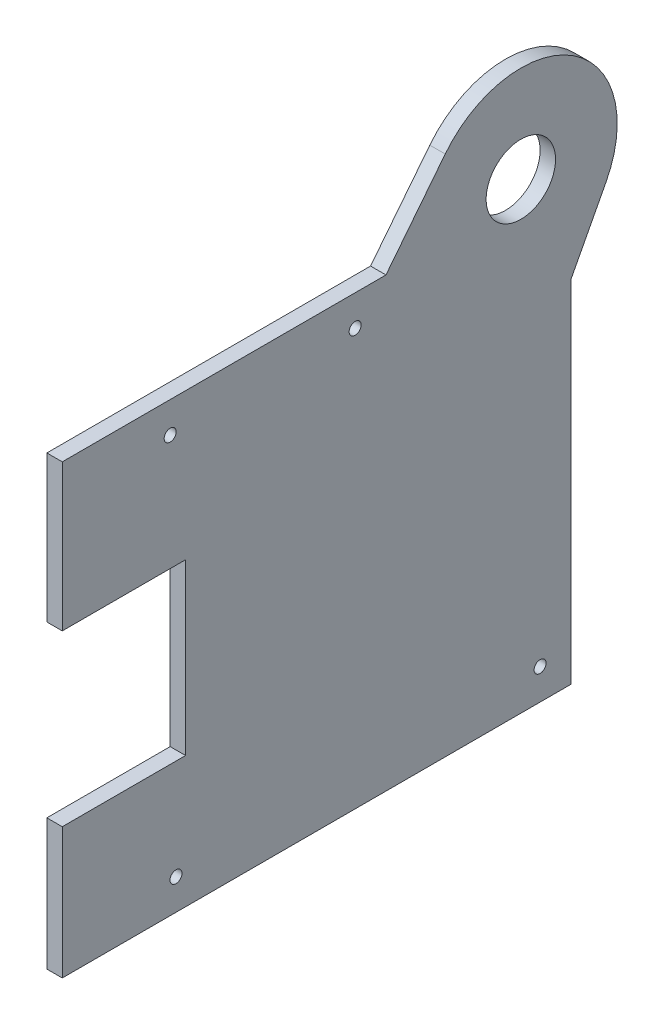
ISO-10303-21;
HEADER;
FILE_DESCRIPTION(('STEP AP214'),'2;1');
FILE_NAME('part.step','',(''),(''),'','','');
FILE_SCHEMA(('AUTOMOTIVE_DESIGN { 1 0 10303 214 1 1 1 1 }'));
ENDSEC;
DATA;
#1=APPLICATION_CONTEXT('core data for automotive mechanical design processes');
#2=APPLICATION_PROTOCOL_DEFINITION('international standard','automotive_design',2000,#1);
#3=PRODUCT_CONTEXT('',#1,'mechanical');
#4=PRODUCT('Part','Part','',(#3));
#5=PRODUCT_RELATED_PRODUCT_CATEGORY('part','',(#4));
#6=PRODUCT_DEFINITION_FORMATION('','',#4);
#7=PRODUCT_DEFINITION_CONTEXT('part definition',#1,'design');
#8=PRODUCT_DEFINITION('design','',#6,#7);
#9=PRODUCT_DEFINITION_SHAPE('','',#8);
#10=(LENGTH_UNIT() NAMED_UNIT(*) SI_UNIT(.MILLI.,.METRE.));
#11=(NAMED_UNIT(*) PLANE_ANGLE_UNIT() SI_UNIT($,.RADIAN.));
#12=(NAMED_UNIT(*) SI_UNIT($,.STERADIAN.) SOLID_ANGLE_UNIT());
#13=UNCERTAINTY_MEASURE_WITH_UNIT(LENGTH_MEASURE(1.E-05),#10,'distance_accuracy_value','');
#14=(GEOMETRIC_REPRESENTATION_CONTEXT(3) GLOBAL_UNCERTAINTY_ASSIGNED_CONTEXT((#13)) GLOBAL_UNIT_ASSIGNED_CONTEXT((#10,
#11,#12)) REPRESENTATION_CONTEXT('',''));
#15=CARTESIAN_POINT('',(0.,0.,0.));
#16=DIRECTION('',(0.,0.,1.));
#17=DIRECTION('',(1.,0.,0.));
#18=AXIS2_PLACEMENT_3D('',#15,#16,#17);
#19=CARTESIAN_POINT('',(6.35,0.,0.));
#20=DIRECTION('',(1.,0.,0.));
#21=DIRECTION('',(0.,0.,-1.));
#22=AXIS2_PLACEMENT_3D('',#19,#20,#21);
#23=PLANE('',#22);
#24=CARTESIAN_POINT('',(6.35,-101.6,57.9249999999993));
#25=DIRECTION('',(1.,0.,0.));
#26=DIRECTION('',(0.,0.,-1.));
#27=AXIS2_PLACEMENT_3D('',#24,#25,#26);
#28=CIRCLE('',#27,2.4765);
#29=CARTESIAN_POINT('',(6.35,-101.6,55.4484999999992));
#30=VERTEX_POINT('',#29);
#31=EDGE_CURVE('E139',#30,#30,#28,.F.);
#32=ORIENTED_EDGE('',*,*,#31,.T.);
#33=EDGE_LOOP('',(#32));
#34=FACE_BOUND('',#33,.T.);
#35=CARTESIAN_POINT('',(6.35,-101.6,-92.0750000000007));
#36=DIRECTION('',(1.,0.,0.));
#37=DIRECTION('',(0.,0.,-1.));
#38=AXIS2_PLACEMENT_3D('',#35,#36,#37);
#39=CIRCLE('',#38,2.47650000000002);
#40=CARTESIAN_POINT('',(6.35,-101.6,-94.5515000000007));
#41=VERTEX_POINT('',#40);
#42=EDGE_CURVE('E142',#41,#41,#39,.F.);
#43=ORIENTED_EDGE('',*,*,#42,.T.);
#44=EDGE_LOOP('',(#43));
#45=FACE_BOUND('',#44,.T.);
#46=CARTESIAN_POINT('',(6.35,57.1499999999992,-15.8749999999998));
#47=DIRECTION('',(1.,0.,0.));
#48=DIRECTION('',(0.,0.,-1.));
#49=AXIS2_PLACEMENT_3D('',#46,#47,#48);
#50=CIRCLE('',#49,2.4765);
#51=CARTESIAN_POINT('',(6.35,57.1499999999992,-18.3514999999998));
#52=VERTEX_POINT('',#51);
#53=EDGE_CURVE('E363',#52,#52,#50,.F.);
#54=ORIENTED_EDGE('',*,*,#53,.T.);
#55=EDGE_LOOP('',(#54));
#56=FACE_BOUND('',#55,.T.);
#57=CARTESIAN_POINT('',(6.35,57.1499999999992,60.3250000000003));
#58=DIRECTION('',(1.,0.,0.));
#59=DIRECTION('',(0.,0.,-1.));
#60=AXIS2_PLACEMENT_3D('',#57,#58,#59);
#61=CIRCLE('',#60,2.4765);
#62=CARTESIAN_POINT('',(6.35,57.1499999999992,57.8485000000003));
#63=VERTEX_POINT('',#62);
#64=EDGE_CURVE('E360',#63,#63,#61,.F.);
#65=ORIENTED_EDGE('',*,*,#64,.T.);
#66=EDGE_LOOP('',(#65));
#67=FACE_BOUND('',#66,.T.);
#68=CARTESIAN_POINT('',(6.35,76.2,-84.1374999999998));
#69=DIRECTION('',(1.,0.,0.));
#70=DIRECTION('',(0.,0.,-1.));
#71=AXIS2_PLACEMENT_3D('',#68,#69,#70);
#72=CIRCLE('',#71,14.2875);
#73=CARTESIAN_POINT('',(6.35,76.2,-98.4249999999998));
#74=VERTEX_POINT('',#73);
#75=EDGE_CURVE('E165',#74,#74,#72,.T.);
#76=ORIENTED_EDGE('',*,*,#75,.F.);
#77=EDGE_LOOP('',(#76));
#78=FACE_BOUND('',#77,.T.);
#79=DIRECTION('',(0.,0.88520131515163,-0.465208159487584));
#80=VECTOR('',#79,1.);
#81=CARTESIAN_POINT('',(6.35,-36.6199134591041,-69.6806255299634));
#82=LINE('',#81,#80);
#83=CARTESIAN_POINT('',(6.35,30.157905892814,-104.775));
#84=VERTEX_POINT('',#83);
#85=CARTESIAN_POINT('',(6.35,57.7370511703365,-119.26892719508));
#86=VERTEX_POINT('',#85);
#87=EDGE_CURVE('E136',#84,#86,#82,.T.);
#88=ORIENTED_EDGE('',*,*,#87,.T.);
#89=CARTESIAN_POINT('',(6.35,76.2,-84.1374999999998));
#90=DIRECTION('',(1.,0.,0.));
#91=DIRECTION('',(0.,0.,-1.));
#92=AXIS2_PLACEMENT_3D('',#89,#90,#91);
#93=CIRCLE('',#92,39.6875);
#94=CARTESIAN_POINT('',(6.35,100.782493632368,-52.9798578705862));
#95=VERTEX_POINT('',#94);
#96=EDGE_CURVE('E119',#86,#95,#93,.T.);
#97=ORIENTED_EDGE('',*,*,#96,.T.);
#98=DIRECTION('',(0.,0.785074447355303,-0.619401414358867));
#99=VECTOR('',#98,1.);
#100=CARTESIAN_POINT('',(6.35,12.9031760566738,16.3544247348979));
#101=LINE('',#100,#99);
#102=CARTESIAN_POINT('',(6.35,69.85,-28.575));
#103=VERTEX_POINT('',#102);
#104=EDGE_CURVE('E129',#103,#95,#101,.T.);
#105=ORIENTED_EDGE('',*,*,#104,.F.);
#106=DIRECTION('',(0.,0.,-1.));
#107=VECTOR('',#106,1.);
#108=CARTESIAN_POINT('',(6.35,69.85,104.775));
#109=LINE('',#108,#107);
#110=CARTESIAN_POINT('',(6.35,69.85,104.775));
#111=VERTEX_POINT('',#110);
#112=EDGE_CURVE('E154',#111,#103,#109,.T.);
#113=ORIENTED_EDGE('',*,*,#112,.F.);
#114=DIRECTION('',(0.,-1.,0.));
#115=VECTOR('',#114,1.);
#116=CARTESIAN_POINT('',(6.35,114.3,104.775));
#117=LINE('',#116,#115);
#118=CARTESIAN_POINT('',(6.35,9.52499999999998,104.775));
#119=VERTEX_POINT('',#118);
#120=EDGE_CURVE('E171',#111,#119,#117,.T.);
#121=ORIENTED_EDGE('',*,*,#120,.T.);
#122=DIRECTION('',(0.,0.,-1.));
#123=VECTOR('',#122,1.);
#124=CARTESIAN_POINT('',(6.35,9.52499999999998,104.775));
#125=LINE('',#124,#123);
#126=CARTESIAN_POINT('',(6.35,9.52500000000001,53.9750000000002));
#127=VERTEX_POINT('',#126);
#128=EDGE_CURVE('E174',#119,#127,#125,.T.);
#129=ORIENTED_EDGE('',*,*,#128,.T.);
#130=DIRECTION('',(0.,-1.,0.));
#131=VECTOR('',#130,1.);
#132=CARTESIAN_POINT('',(6.35,9.52500000000001,53.9750000000002));
#133=LINE('',#132,#131);
#134=CARTESIAN_POINT('',(6.35,-60.325,53.9750000000002));
#135=VERTEX_POINT('',#134);
#136=EDGE_CURVE('E176',#127,#135,#133,.T.);
#137=ORIENTED_EDGE('',*,*,#136,.T.);
#138=DIRECTION('',(0.,0.,1.));
#139=VECTOR('',#138,1.);
#140=CARTESIAN_POINT('',(6.35,-60.325,104.775));
#141=LINE('',#140,#139);
#142=CARTESIAN_POINT('',(6.35,-60.325,104.775));
#143=VERTEX_POINT('',#142);
#144=EDGE_CURVE('E178',#135,#143,#141,.T.);
#145=ORIENTED_EDGE('',*,*,#144,.T.);
#146=DIRECTION('',(0.,-1.,0.));
#147=VECTOR('',#146,1.);
#148=CARTESIAN_POINT('',(6.35,-60.325,104.775));
#149=LINE('',#148,#147);
#150=CARTESIAN_POINT('',(6.35,-114.3,104.775));
#151=VERTEX_POINT('',#150);
#152=EDGE_CURVE('E180',#143,#151,#149,.T.);
#153=ORIENTED_EDGE('',*,*,#152,.T.);
#154=DIRECTION('',(0.,0.,-1.));
#155=VECTOR('',#154,1.);
#156=CARTESIAN_POINT('',(6.35,-114.3,104.775));
#157=LINE('',#156,#155);
#158=CARTESIAN_POINT('',(6.35,-114.3,-104.775));
#159=VERTEX_POINT('',#158);
#160=EDGE_CURVE('E182',#151,#159,#157,.T.);
#161=ORIENTED_EDGE('',*,*,#160,.T.);
#162=DIRECTION('',(0.,1.,0.));
#163=VECTOR('',#162,1.);
#164=CARTESIAN_POINT('',(6.35,114.3,-104.775));
#165=LINE('',#164,#163);
#166=EDGE_CURVE('E138',#159,#84,#165,.T.);
#167=ORIENTED_EDGE('',*,*,#166,.T.);
#168=EDGE_LOOP('',(#88,#97,#105,#113,#121,#129,#137,#145,#153,#161,#167));
#169=FACE_BOUND('',#168,.T.);
#170=ADVANCED_FACE('F35',(#34,#45,#56,#67,#78,#169),#23,.T.);
#171=CARTESIAN_POINT('',(0.,0.,0.));
#172=DIRECTION('',(1.,0.,0.));
#173=DIRECTION('',(0.,0.,-1.));
#174=AXIS2_PLACEMENT_3D('',#171,#172,#173);
#175=PLANE('',#174);
#176=CARTESIAN_POINT('',(0.,-101.6,57.9249999999993));
#177=DIRECTION('',(1.,0.,0.));
#178=DIRECTION('',(0.,0.,-1.));
#179=AXIS2_PLACEMENT_3D('',#176,#177,#178);
#180=CIRCLE('',#179,2.4765);
#181=CARTESIAN_POINT('',(0.,-101.6,55.4484999999992));
#182=VERTEX_POINT('',#181);
#183=EDGE_CURVE('E349',#182,#182,#180,.T.);
#184=ORIENTED_EDGE('',*,*,#183,.T.);
#185=EDGE_LOOP('',(#184));
#186=FACE_BOUND('',#185,.T.);
#187=CARTESIAN_POINT('',(0.,-101.6,-92.0750000000007));
#188=DIRECTION('',(1.,0.,0.));
#189=DIRECTION('',(0.,0.,-1.));
#190=AXIS2_PLACEMENT_3D('',#187,#188,#189);
#191=CIRCLE('',#190,2.47650000000002);
#192=CARTESIAN_POINT('',(0.,-101.6,-94.5515000000007));
#193=VERTEX_POINT('',#192);
#194=EDGE_CURVE('E350',#193,#193,#191,.T.);
#195=ORIENTED_EDGE('',*,*,#194,.T.);
#196=EDGE_LOOP('',(#195));
#197=FACE_BOUND('',#196,.T.);
#198=CARTESIAN_POINT('',(0.,57.1499999999992,-15.8749999999998));
#199=DIRECTION('',(1.,0.,0.));
#200=DIRECTION('',(0.,0.,-1.));
#201=AXIS2_PLACEMENT_3D('',#198,#199,#200);
#202=CIRCLE('',#201,2.4765);
#203=CARTESIAN_POINT('',(0.,57.1499999999992,-18.3514999999998));
#204=VERTEX_POINT('',#203);
#205=EDGE_CURVE('E353',#204,#204,#202,.T.);
#206=ORIENTED_EDGE('',*,*,#205,.T.);
#207=EDGE_LOOP('',(#206));
#208=FACE_BOUND('',#207,.T.);
#209=CARTESIAN_POINT('',(0.,57.1499999999992,60.3250000000003));
#210=DIRECTION('',(1.,0.,0.));
#211=DIRECTION('',(0.,0.,-1.));
#212=AXIS2_PLACEMENT_3D('',#209,#210,#211);
#213=CIRCLE('',#212,2.4765);
#214=CARTESIAN_POINT('',(0.,57.1499999999992,57.8485000000003));
#215=VERTEX_POINT('',#214);
#216=EDGE_CURVE('E357',#215,#215,#213,.T.);
#217=ORIENTED_EDGE('',*,*,#216,.T.);
#218=EDGE_LOOP('',(#217));
#219=FACE_BOUND('',#218,.T.);
#220=CARTESIAN_POINT('',(0.,76.2,-84.1374999999998));
#221=DIRECTION('',(1.,0.,0.));
#222=DIRECTION('',(0.,0.,-1.));
#223=AXIS2_PLACEMENT_3D('',#220,#221,#222);
#224=CIRCLE('',#223,14.2875);
#225=CARTESIAN_POINT('',(0.,76.2,-98.4249999999998));
#226=VERTEX_POINT('',#225);
#227=EDGE_CURVE('E163',#226,#226,#224,.T.);
#228=ORIENTED_EDGE('',*,*,#227,.T.);
#229=EDGE_LOOP('',(#228));
#230=FACE_BOUND('',#229,.T.);
#231=CARTESIAN_POINT('',(0.,76.2,-84.1374999999998));
#232=DIRECTION('',(1.,0.,0.));
#233=DIRECTION('',(0.,0.,-1.));
#234=AXIS2_PLACEMENT_3D('',#231,#232,#233);
#235=CIRCLE('',#234,39.6875);
#236=CARTESIAN_POINT('',(0.,57.7370511703365,-119.26892719508));
#237=VERTEX_POINT('',#236);
#238=CARTESIAN_POINT('',(0.,100.782493632368,-52.9798578705862));
#239=VERTEX_POINT('',#238);
#240=EDGE_CURVE('E147',#237,#239,#235,.T.);
#241=ORIENTED_EDGE('',*,*,#240,.F.);
#242=DIRECTION('',(0.,-0.88520131515163,0.465208159487584));
#243=VECTOR('',#242,1.);
#244=CARTESIAN_POINT('',(0.,-36.6199134591041,-69.6806255299634));
#245=LINE('',#244,#243);
#246=CARTESIAN_POINT('',(0.,30.157905892814,-104.775));
#247=VERTEX_POINT('',#246);
#248=EDGE_CURVE('E130',#237,#247,#245,.T.);
#249=ORIENTED_EDGE('',*,*,#248,.T.);
#250=DIRECTION('',(0.,1.,0.));
#251=VECTOR('',#250,1.);
#252=CARTESIAN_POINT('',(0.,114.3,-104.775));
#253=LINE('',#252,#251);
#254=CARTESIAN_POINT('',(0.,-114.3,-104.775));
#255=VERTEX_POINT('',#254);
#256=EDGE_CURVE('E50',#255,#247,#253,.T.);
#257=ORIENTED_EDGE('',*,*,#256,.F.);
#258=DIRECTION('',(0.,0.,-1.));
#259=VECTOR('',#258,1.);
#260=CARTESIAN_POINT('',(0.,-114.3,104.775));
#261=LINE('',#260,#259);
#262=CARTESIAN_POINT('',(0.,-114.3,104.775));
#263=VERTEX_POINT('',#262);
#264=EDGE_CURVE('E172',#263,#255,#261,.T.);
#265=ORIENTED_EDGE('',*,*,#264,.F.);
#266=DIRECTION('',(0.,-1.,0.));
#267=VECTOR('',#266,1.);
#268=CARTESIAN_POINT('',(0.,-60.325,104.775));
#269=LINE('',#268,#267);
#270=CARTESIAN_POINT('',(0.,-60.325,104.775));
#271=VERTEX_POINT('',#270);
#272=EDGE_CURVE('E194',#271,#263,#269,.T.);
#273=ORIENTED_EDGE('',*,*,#272,.F.);
#274=DIRECTION('',(0.,0.,1.));
#275=VECTOR('',#274,1.);
#276=CARTESIAN_POINT('',(0.,-60.325,104.775));
#277=LINE('',#276,#275);
#278=CARTESIAN_POINT('',(0.,-60.325,53.9750000000002));
#279=VERTEX_POINT('',#278);
#280=EDGE_CURVE('E192',#279,#271,#277,.T.);
#281=ORIENTED_EDGE('',*,*,#280,.F.);
#282=DIRECTION('',(0.,-1.,0.));
#283=VECTOR('',#282,1.);
#284=CARTESIAN_POINT('',(0.,9.52500000000001,53.9750000000002));
#285=LINE('',#284,#283);
#286=CARTESIAN_POINT('',(0.,9.52500000000001,53.9750000000002));
#287=VERTEX_POINT('',#286);
#288=EDGE_CURVE('E190',#287,#279,#285,.T.);
#289=ORIENTED_EDGE('',*,*,#288,.F.);
#290=DIRECTION('',(0.,0.,-1.));
#291=VECTOR('',#290,1.);
#292=CARTESIAN_POINT('',(0.,9.52499999999998,104.775));
#293=LINE('',#292,#291);
#294=CARTESIAN_POINT('',(0.,9.52499999999998,104.775));
#295=VERTEX_POINT('',#294);
#296=EDGE_CURVE('E188',#295,#287,#293,.T.);
#297=ORIENTED_EDGE('',*,*,#296,.F.);
#298=DIRECTION('',(0.,-1.,0.));
#299=VECTOR('',#298,1.);
#300=CARTESIAN_POINT('',(0.,114.3,104.775));
#301=LINE('',#300,#299);
#302=CARTESIAN_POINT('',(0.,69.85,104.775));
#303=VERTEX_POINT('',#302);
#304=EDGE_CURVE('E186',#303,#295,#301,.T.);
#305=ORIENTED_EDGE('',*,*,#304,.F.);
#306=DIRECTION('',(0.,0.,-1.));
#307=VECTOR('',#306,1.);
#308=CARTESIAN_POINT('',(0.,69.85,104.775));
#309=LINE('',#308,#307);
#310=CARTESIAN_POINT('',(0.,69.85,-28.575));
#311=VERTEX_POINT('',#310);
#312=EDGE_CURVE('E155',#303,#311,#309,.T.);
#313=ORIENTED_EDGE('',*,*,#312,.T.);
#314=DIRECTION('',(0.,0.785074447355303,-0.619401414358867));
#315=VECTOR('',#314,1.);
#316=CARTESIAN_POINT('',(0.,12.9031760566738,16.3544247348979));
#317=LINE('',#316,#315);
#318=EDGE_CURVE('E149',#311,#239,#317,.T.);
#319=ORIENTED_EDGE('',*,*,#318,.T.);
#320=EDGE_LOOP('',(#241,#249,#257,#265,#273,#281,#289,#297,#305,#313,#319));
#321=FACE_BOUND('',#320,.T.);
#322=ADVANCED_FACE('F218',(#186,#197,#208,#219,#230,#321),#175,.F.);
#323=CARTESIAN_POINT('',(6.35,114.3,-104.775));
#324=DIRECTION('',(0.,0.,1.));
#325=DIRECTION('',(1.,0.,0.));
#326=AXIS2_PLACEMENT_3D('',#323,#324,#325);
#327=PLANE('',#326);
#328=ORIENTED_EDGE('',*,*,#256,.T.);
#329=DIRECTION('',(1.,0.,0.));
#330=VECTOR('',#329,1.);
#331=CARTESIAN_POINT('',(-82.1802694956537,30.157905892814,-104.775));
#332=LINE('',#331,#330);
#333=EDGE_CURVE('E55',#247,#84,#332,.T.);
#334=ORIENTED_EDGE('',*,*,#333,.T.);
#335=ORIENTED_EDGE('',*,*,#166,.F.);
#336=DIRECTION('',(-1.,0.,0.));
#337=VECTOR('',#336,1.);
#338=CARTESIAN_POINT('',(6.35,-114.3,-104.775));
#339=LINE('',#338,#337);
#340=EDGE_CURVE('E184',#159,#255,#339,.T.);
#341=ORIENTED_EDGE('',*,*,#340,.T.);
#342=EDGE_LOOP('',(#328,#334,#335,#341));
#343=FACE_BOUND('',#342,.T.);
#344=ADVANCED_FACE('F37',(#343),#327,.F.);
#345=CARTESIAN_POINT('',(6.35,114.3,104.775));
#346=DIRECTION('',(0.,0.,-1.));
#347=DIRECTION('',(0.,1.,0.));
#348=AXIS2_PLACEMENT_3D('',#345,#346,#347);
#349=PLANE('',#348);
#350=ORIENTED_EDGE('',*,*,#120,.F.);
#351=DIRECTION('',(1.,0.,0.));
#352=VECTOR('',#351,1.);
#353=CARTESIAN_POINT('',(0.,69.85,104.775));
#354=LINE('',#353,#352);
#355=EDGE_CURVE('E158',#303,#111,#354,.T.);
#356=ORIENTED_EDGE('',*,*,#355,.F.);
#357=ORIENTED_EDGE('',*,*,#304,.T.);
#358=DIRECTION('',(-1.,0.,0.));
#359=VECTOR('',#358,1.);
#360=CARTESIAN_POINT('',(6.35,9.52499999999998,104.775));
#361=LINE('',#360,#359);
#362=EDGE_CURVE('E11',#119,#295,#361,.T.);
#363=ORIENTED_EDGE('',*,*,#362,.F.);
#364=EDGE_LOOP('',(#350,#356,#357,#363));
#365=FACE_BOUND('',#364,.T.);
#366=ADVANCED_FACE('F237',(#365),#349,.F.);
#367=CARTESIAN_POINT('',(6.35,9.52499999999998,104.775));
#368=DIRECTION('',(0.,1.,0.));
#369=DIRECTION('',(0.,0.,1.));
#370=AXIS2_PLACEMENT_3D('',#367,#368,#369);
#371=PLANE('',#370);
#372=ORIENTED_EDGE('',*,*,#296,.T.);
#373=DIRECTION('',(-1.,0.,0.));
#374=VECTOR('',#373,1.);
#375=CARTESIAN_POINT('',(6.35,9.52500000000001,53.9750000000002));
#376=LINE('',#375,#374);
#377=EDGE_CURVE('E43',#127,#287,#376,.T.);
#378=ORIENTED_EDGE('',*,*,#377,.F.);
#379=ORIENTED_EDGE('',*,*,#128,.F.);
#380=ORIENTED_EDGE('',*,*,#362,.T.);
#381=EDGE_LOOP('',(#372,#378,#379,#380));
#382=FACE_BOUND('',#381,.T.);
#383=ADVANCED_FACE('F235',(#382),#371,.F.);
#384=CARTESIAN_POINT('',(6.35,9.52500000000001,53.9750000000002));
#385=DIRECTION('',(0.,0.,-1.));
#386=DIRECTION('',(0.,1.,0.));
#387=AXIS2_PLACEMENT_3D('',#384,#385,#386);
#388=PLANE('',#387);
#389=ORIENTED_EDGE('',*,*,#288,.T.);
#390=DIRECTION('',(-1.,0.,0.));
#391=VECTOR('',#390,1.);
#392=CARTESIAN_POINT('',(6.35,-60.325,53.9750000000002));
#393=LINE('',#392,#391);
#394=EDGE_CURVE('E204',#135,#279,#393,.T.);
#395=ORIENTED_EDGE('',*,*,#394,.F.);
#396=ORIENTED_EDGE('',*,*,#136,.F.);
#397=ORIENTED_EDGE('',*,*,#377,.T.);
#398=EDGE_LOOP('',(#389,#395,#396,#397));
#399=FACE_BOUND('',#398,.T.);
#400=ADVANCED_FACE('F211',(#399),#388,.F.);
#401=CARTESIAN_POINT('',(6.35,-60.325,104.775));
#402=DIRECTION('',(0.,-1.,0.));
#403=DIRECTION('',(0.,0.,-1.));
#404=AXIS2_PLACEMENT_3D('',#401,#402,#403);
#405=PLANE('',#404);
#406=ORIENTED_EDGE('',*,*,#280,.T.);
#407=DIRECTION('',(-1.,0.,0.));
#408=VECTOR('',#407,1.);
#409=CARTESIAN_POINT('',(6.35,-60.325,104.775));
#410=LINE('',#409,#408);
#411=EDGE_CURVE('E201',#143,#271,#410,.T.);
#412=ORIENTED_EDGE('',*,*,#411,.F.);
#413=ORIENTED_EDGE('',*,*,#144,.F.);
#414=ORIENTED_EDGE('',*,*,#394,.T.);
#415=EDGE_LOOP('',(#406,#412,#413,#414));
#416=FACE_BOUND('',#415,.T.);
#417=ADVANCED_FACE('F224',(#416),#405,.F.);
#418=CARTESIAN_POINT('',(6.35,-60.325,104.775));
#419=DIRECTION('',(0.,0.,-1.));
#420=DIRECTION('',(0.,1.,0.));
#421=AXIS2_PLACEMENT_3D('',#418,#419,#420);
#422=PLANE('',#421);
#423=ORIENTED_EDGE('',*,*,#272,.T.);
#424=DIRECTION('',(-1.,0.,0.));
#425=VECTOR('',#424,1.);
#426=CARTESIAN_POINT('',(6.35,-114.3,104.775));
#427=LINE('',#426,#425);
#428=EDGE_CURVE('E198',#151,#263,#427,.T.);
#429=ORIENTED_EDGE('',*,*,#428,.F.);
#430=ORIENTED_EDGE('',*,*,#152,.F.);
#431=ORIENTED_EDGE('',*,*,#411,.T.);
#432=EDGE_LOOP('',(#423,#429,#430,#431));
#433=FACE_BOUND('',#432,.T.);
#434=ADVANCED_FACE('F228',(#433),#422,.F.);
#435=CARTESIAN_POINT('',(6.35,-114.3,104.775));
#436=DIRECTION('',(0.,1.,0.));
#437=DIRECTION('',(0.,0.,1.));
#438=AXIS2_PLACEMENT_3D('',#435,#436,#437);
#439=PLANE('',#438);
#440=ORIENTED_EDGE('',*,*,#264,.T.);
#441=ORIENTED_EDGE('',*,*,#340,.F.);
#442=ORIENTED_EDGE('',*,*,#160,.F.);
#443=ORIENTED_EDGE('',*,*,#428,.T.);
#444=EDGE_LOOP('',(#440,#441,#442,#443));
#445=FACE_BOUND('',#444,.T.);
#446=ADVANCED_FACE('F267',(#445),#439,.F.);
#447=CARTESIAN_POINT('',(6.35,76.2,-84.1374999999998));
#448=DIRECTION('',(-1.,0.,0.));
#449=DIRECTION('',(0.,0.,1.));
#450=AXIS2_PLACEMENT_3D('',#447,#448,#449);
#451=CYLINDRICAL_SURFACE('',#450,14.2875);
#452=ORIENTED_EDGE('',*,*,#75,.T.);
#453=EDGE_LOOP('',(#452));
#454=FACE_BOUND('',#453,.T.);
#455=ORIENTED_EDGE('',*,*,#227,.F.);
#456=EDGE_LOOP('',(#455));
#457=FACE_BOUND('',#456,.T.);
#458=ADVANCED_FACE('F264',(#454,#457),#451,.F.);
#459=CARTESIAN_POINT('',(0.,69.85,104.775));
#460=DIRECTION('',(0.,-1.,0.));
#461=DIRECTION('',(0.,0.,-1.));
#462=AXIS2_PLACEMENT_3D('',#459,#460,#461);
#463=PLANE('',#462);
#464=ORIENTED_EDGE('',*,*,#112,.T.);
#465=DIRECTION('',(1.,0.,0.));
#466=VECTOR('',#465,1.);
#467=CARTESIAN_POINT('',(0.,69.85,-28.575));
#468=LINE('',#467,#466);
#469=EDGE_CURVE('E161',#311,#103,#468,.T.);
#470=ORIENTED_EDGE('',*,*,#469,.F.);
#471=ORIENTED_EDGE('',*,*,#312,.F.);
#472=ORIENTED_EDGE('',*,*,#355,.T.);
#473=EDGE_LOOP('',(#464,#470,#471,#472));
#474=FACE_BOUND('',#473,.T.);
#475=ADVANCED_FACE('F241',(#474),#463,.F.);
#476=CARTESIAN_POINT('',(0.,76.2,-84.1374999999998));
#477=DIRECTION('',(1.,0.,0.));
#478=DIRECTION('',(0.,0.,-1.));
#479=AXIS2_PLACEMENT_3D('',#476,#477,#478);
#480=CYLINDRICAL_SURFACE('',#479,39.6875);
#481=ORIENTED_EDGE('',*,*,#96,.F.);
#482=DIRECTION('',(1.,0.,0.));
#483=VECTOR('',#482,1.);
#484=CARTESIAN_POINT('',(-82.1802694956537,57.7370511703365,-119.26892719508));
#485=LINE('',#484,#483);
#486=EDGE_CURVE('E122',#237,#86,#485,.T.);
#487=ORIENTED_EDGE('',*,*,#486,.F.);
#488=ORIENTED_EDGE('',*,*,#240,.T.);
#489=DIRECTION('',(1.,0.,0.));
#490=VECTOR('',#489,1.);
#491=CARTESIAN_POINT('',(0.,100.782493632368,-52.9798578705862));
#492=LINE('',#491,#490);
#493=EDGE_CURVE('E124',#239,#95,#492,.T.);
#494=ORIENTED_EDGE('',*,*,#493,.T.);
#495=EDGE_LOOP('',(#481,#487,#488,#494));
#496=FACE_BOUND('',#495,.T.);
#497=ADVANCED_FACE('F121',(#496),#480,.T.);
#498=CARTESIAN_POINT('',(0.,12.9031760566738,16.3544247348979));
#499=DIRECTION('',(0.,-0.619401414358867,-0.785074447355303));
#500=DIRECTION('',(0.,0.785074447355303,-0.619401414358867));
#501=AXIS2_PLACEMENT_3D('',#498,#499,#500);
#502=PLANE('',#501);
#503=ORIENTED_EDGE('',*,*,#104,.T.);
#504=ORIENTED_EDGE('',*,*,#493,.F.);
#505=ORIENTED_EDGE('',*,*,#318,.F.);
#506=ORIENTED_EDGE('',*,*,#469,.T.);
#507=EDGE_LOOP('',(#503,#504,#505,#506));
#508=FACE_BOUND('',#507,.T.);
#509=ADVANCED_FACE('F243',(#508),#502,.F.);
#510=CARTESIAN_POINT('',(-82.1802694956537,-36.6199134591041,-69.6806255299634));
#511=DIRECTION('',(0.,-0.465208159487584,-0.885201315151629));
#512=DIRECTION('',(0.,0.88520131515163,-0.465208159487584));
#513=AXIS2_PLACEMENT_3D('',#510,#511,#512);
#514=PLANE('',#513);
#515=ORIENTED_EDGE('',*,*,#248,.F.);
#516=ORIENTED_EDGE('',*,*,#486,.T.);
#517=ORIENTED_EDGE('',*,*,#87,.F.);
#518=ORIENTED_EDGE('',*,*,#333,.F.);
#519=EDGE_LOOP('',(#515,#516,#517,#518));
#520=FACE_BOUND('',#519,.T.);
#521=ADVANCED_FACE('F135',(#520),#514,.T.);
#522=CARTESIAN_POINT('',(8.89,57.1499999999992,60.3250000000003));
#523=DIRECTION('',(-1.,0.,0.));
#524=DIRECTION('',(0.,0.,1.));
#525=AXIS2_PLACEMENT_3D('',#522,#523,#524);
#526=CYLINDRICAL_SURFACE('',#525,2.4765);
#527=ORIENTED_EDGE('',*,*,#64,.F.);
#528=EDGE_LOOP('',(#527));
#529=FACE_BOUND('',#528,.T.);
#530=ORIENTED_EDGE('',*,*,#216,.F.);
#531=EDGE_LOOP('',(#530));
#532=FACE_BOUND('',#531,.T.);
#533=ADVANCED_FACE('F250',(#529,#532),#526,.F.);
#534=CARTESIAN_POINT('',(8.89,57.1499999999992,-15.8749999999998));
#535=DIRECTION('',(-1.,0.,0.));
#536=DIRECTION('',(0.,0.,1.));
#537=AXIS2_PLACEMENT_3D('',#534,#535,#536);
#538=CYLINDRICAL_SURFACE('',#537,2.4765);
#539=ORIENTED_EDGE('',*,*,#53,.F.);
#540=EDGE_LOOP('',(#539));
#541=FACE_BOUND('',#540,.T.);
#542=ORIENTED_EDGE('',*,*,#205,.F.);
#543=EDGE_LOOP('',(#542));
#544=FACE_BOUND('',#543,.T.);
#545=ADVANCED_FACE('F311',(#541,#544),#538,.F.);
#546=CARTESIAN_POINT('',(8.89,-101.6,-92.0750000000007));
#547=DIRECTION('',(-1.,0.,0.));
#548=DIRECTION('',(0.,0.,1.));
#549=AXIS2_PLACEMENT_3D('',#546,#547,#548);
#550=CYLINDRICAL_SURFACE('',#549,2.47650000000002);
#551=ORIENTED_EDGE('',*,*,#42,.F.);
#552=EDGE_LOOP('',(#551));
#553=FACE_BOUND('',#552,.T.);
#554=ORIENTED_EDGE('',*,*,#194,.F.);
#555=EDGE_LOOP('',(#554));
#556=FACE_BOUND('',#555,.T.);
#557=ADVANCED_FACE('F318',(#553,#556),#550,.F.);
#558=CARTESIAN_POINT('',(8.89,-101.6,57.9249999999993));
#559=DIRECTION('',(-1.,0.,0.));
#560=DIRECTION('',(0.,0.,1.));
#561=AXIS2_PLACEMENT_3D('',#558,#559,#560);
#562=CYLINDRICAL_SURFACE('',#561,2.4765);
#563=ORIENTED_EDGE('',*,*,#31,.F.);
#564=EDGE_LOOP('',(#563));
#565=FACE_BOUND('',#564,.T.);
#566=ORIENTED_EDGE('',*,*,#183,.F.);
#567=EDGE_LOOP('',(#566));
#568=FACE_BOUND('',#567,.T.);
#569=ADVANCED_FACE('F326',(#565,#568),#562,.F.);
#570=CLOSED_SHELL('',(#170,#322,#344,#366,#383,#400,#417,#434,#446,#458,#475,#497,#509,#521,
#533,#545,#557,#569));
#571=MANIFOLD_SOLID_BREP('B2',#570);
#572=ADVANCED_BREP_SHAPE_REPRESENTATION('',(#18,#571),#14);
#573=SHAPE_DEFINITION_REPRESENTATION(#9,#572);
ENDSEC;
END-ISO-10303-21;
